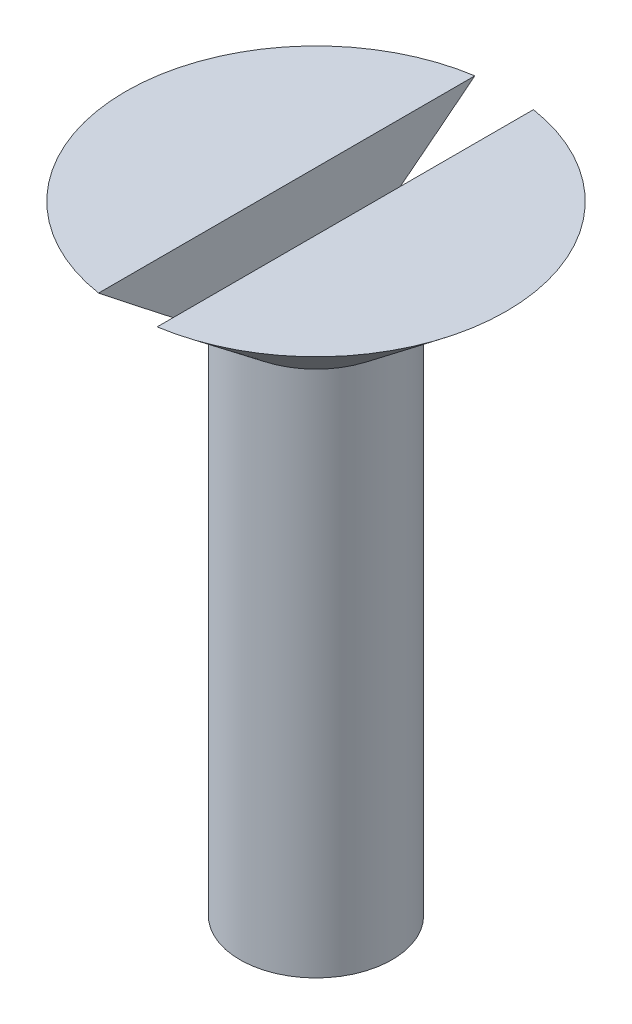
ISO-10303-21;
HEADER;
FILE_DESCRIPTION(('STEP AP214'),'2;1');
FILE_NAME('part.step','',(''),(''),'','','');
FILE_SCHEMA(('AUTOMOTIVE_DESIGN { 1 0 10303 214 1 1 1 1 }'));
ENDSEC;
DATA;
#1=APPLICATION_CONTEXT('core data for automotive mechanical design processes');
#2=APPLICATION_PROTOCOL_DEFINITION('international standard','automotive_design',2000,#1);
#3=PRODUCT_CONTEXT('',#1,'mechanical');
#4=PRODUCT('Part','Part','',(#3));
#5=PRODUCT_RELATED_PRODUCT_CATEGORY('part','',(#4));
#6=PRODUCT_DEFINITION_FORMATION('','',#4);
#7=PRODUCT_DEFINITION_CONTEXT('part definition',#1,'design');
#8=PRODUCT_DEFINITION('design','',#6,#7);
#9=PRODUCT_DEFINITION_SHAPE('','',#8);
#10=(LENGTH_UNIT() NAMED_UNIT(*) SI_UNIT(.MILLI.,.METRE.));
#11=(NAMED_UNIT(*) PLANE_ANGLE_UNIT() SI_UNIT($,.RADIAN.));
#12=(NAMED_UNIT(*) SI_UNIT($,.STERADIAN.) SOLID_ANGLE_UNIT());
#13=UNCERTAINTY_MEASURE_WITH_UNIT(LENGTH_MEASURE(1.E-05),#10,'distance_accuracy_value','');
#14=(GEOMETRIC_REPRESENTATION_CONTEXT(3) GLOBAL_UNCERTAINTY_ASSIGNED_CONTEXT((#13)) GLOBAL_UNIT_ASSIGNED_CONTEXT((#10,
#11,#12)) REPRESENTATION_CONTEXT('',''));
#15=CARTESIAN_POINT('',(0.,0.,0.));
#16=DIRECTION('',(0.,0.,1.));
#17=DIRECTION('',(1.,0.,0.));
#18=AXIS2_PLACEMENT_3D('',#15,#16,#17);
#19=CARTESIAN_POINT('',(6.50000000000002,22.6264981604973,0.));
#20=DIRECTION('',(0.,-1.,0.));
#21=DIRECTION('',(1.,0.,0.));
#22=AXIS2_PLACEMENT_3D('',#19,#20,#21);
#23=PLANE('',#22);
#24=CARTESIAN_POINT('',(0.,22.6264981604973,0.));
#25=DIRECTION('',(0.,1.,0.));
#26=DIRECTION('',(-1.,0.,0.));
#27=AXIS2_PLACEMENT_3D('',#24,#25,#26);
#28=CIRCLE('',#27,6.5);
#29=CARTESIAN_POINT('',(0.999999999999997,22.6264981604973,6.42261628933255));
#30=VERTEX_POINT('',#29);
#31=CARTESIAN_POINT('',(0.999999999999997,22.6264981604973,-6.42261628933257));
#32=VERTEX_POINT('',#31);
#33=EDGE_CURVE('E98',#30,#32,#28,.T.);
#34=ORIENTED_EDGE('',*,*,#33,.T.);
#35=DIRECTION('',(0.,0.,-1.));
#36=VECTOR('',#35,1.);
#37=CARTESIAN_POINT('',(0.999999999999997,22.6264981604973,7.49999999999999));
#38=LINE('',#37,#36);
#39=EDGE_CURVE('E91',#30,#32,#38,.T.);
#40=ORIENTED_EDGE('',*,*,#39,.F.);
#41=EDGE_LOOP('',(#34,#40));
#42=FACE_BOUND('',#41,.T.);
#43=ADVANCED_FACE('F44',(#42),#23,.F.);
#44=CARTESIAN_POINT('',(-1.,22.6264981604973,-6.42261628933256));
#45=VERTEX_POINT('',#44);
#46=CARTESIAN_POINT('',(-1.,22.6264981604973,6.42261628933254));
#47=VERTEX_POINT('',#46);
#48=EDGE_CURVE('E105',#45,#47,#28,.T.);
#49=ORIENTED_EDGE('',*,*,#48,.T.);
#50=DIRECTION('',(0.,0.,1.));
#51=VECTOR('',#50,1.);
#52=CARTESIAN_POINT('',(-1.,22.6264981604973,7.49999999999999));
#53=LINE('',#52,#51);
#54=EDGE_CURVE('E99',#45,#47,#53,.T.);
#55=ORIENTED_EDGE('',*,*,#54,.F.);
#56=EDGE_LOOP('',(#49,#55));
#57=FACE_BOUND('',#56,.T.);
#58=ADVANCED_FACE('F46',(#57),#23,.F.);
#59=CARTESIAN_POINT('',(0.,19.5,0.));
#60=DIRECTION('',(0.,1.,0.));
#61=DIRECTION('',(-1.,0.,0.));
#62=AXIS2_PLACEMENT_3D('',#59,#60,#61);
#63=CONICAL_SURFACE('',#62,2.59807621135329,0.895280898571727);
#64=ORIENTED_EDGE('',*,*,#33,.F.);
#65=CARTESIAN_POINT('',(0.999999999999997,28.9779066227362,14.3919678627795));
#66=CARTESIAN_POINT('',(0.999999999999997,28.568515737515,13.8797975728752));
#67=CARTESIAN_POINT('',(0.999999999999997,28.159178409321,13.3675844242118));
#68=CARTESIAN_POINT('',(0.999999999999997,27.3406414570373,12.3429568360387));
#69=CARTESIAN_POINT('',(0.999999999999997,26.9314418527713,11.8305423806936));
#70=CARTESIAN_POINT('',(0.999999999999997,26.1124587766563,10.8044540069552));
#71=CARTESIAN_POINT('',(0.999999999999997,25.7026758346903,10.290779665593));
#72=CARTESIAN_POINT('',(0.999999999999997,24.8835511692291,9.26316946708095));
#73=CARTESIAN_POINT('',(0.999999999999997,24.4742094030464,8.74923364397171));
#74=CARTESIAN_POINT('',(0.999999999999997,23.8489635977186,7.96318031506497));
#75=CARTESIAN_POINT('',(0.999999999999997,23.6328191557736,7.69125405087661));
#76=CARTESIAN_POINT('',(0.999999999999997,23.2007852203086,7.14719381882096));
#77=CARTESIAN_POINT('',(0.999999999999997,22.9848957298058,6.87505984855711));
#78=CARTESIAN_POINT('',(0.999999999999997,22.5534064052927,6.3304130621767));
#79=CARTESIAN_POINT('',(0.999999999999997,22.3378066933802,6.05790014931072));
#80=CARTESIAN_POINT('',(0.999999999999997,21.90714930459,5.51246494642735));
#81=CARTESIAN_POINT('',(0.999999999999997,21.6920916049026,5.23954267443508));
#82=CARTESIAN_POINT('',(0.999999999999997,21.263123108631,4.69343709136958));
#83=CARTESIAN_POINT('',(0.999999999999997,21.0492111019867,4.4202547310336));
#84=CARTESIAN_POINT('',(0.999999999999997,20.6227311054927,3.8727694723508));
#85=CARTESIAN_POINT('',(0.999999999999997,20.410163334688,3.59846640278985));
#86=CARTESIAN_POINT('',(0.999999999999997,20.0933718272538,3.18557336931416));
#87=CARTESIAN_POINT('',(0.999999999999997,19.9881524518509,3.04774840929994));
#88=CARTESIAN_POINT('',(0.999999999999997,19.778697508504,2.77134102138812));
#89=CARTESIAN_POINT('',(0.999999999999997,19.6744619917711,2.63275855464778));
#90=CARTESIAN_POINT('',(0.999999999999997,19.4675196786719,2.35451211639593));
#91=CARTESIAN_POINT('',(0.999999999999997,19.3648124529729,2.21484846603981));
#92=CARTESIAN_POINT('',(0.999999999999997,19.2126371247218,2.00399999535382));
#93=CARTESIAN_POINT('',(0.999999999999997,19.1622283841718,1.93349471917426));
#94=CARTESIAN_POINT('',(0.999999999999997,19.0622557173489,1.79188848398646));
#95=CARTESIAN_POINT('',(0.999999999999997,19.0126917669353,1.72078754208689));
#96=CARTESIAN_POINT('',(0.999999999999997,18.9417357762063,1.61722495638402));
#97=CARTESIAN_POINT('',(0.999999999999997,18.9198821271097,1.58507957035332));
#98=CARTESIAN_POINT('',(0.999999999999997,18.8764474649958,1.52060449074986));
#99=CARTESIAN_POINT('',(0.999999999999997,18.8548664563562,1.48827479422961));
#100=CARTESIAN_POINT('',(0.999999999999997,18.7905939553486,1.39096490802436));
#101=CARTESIAN_POINT('',(0.999999999999997,18.748376708571,1.32566932247498));
#102=CARTESIAN_POINT('',(0.999999999999997,18.6656357187635,1.19383115347468));
#103=CARTESIAN_POINT('',(0.999999999999997,18.625115415215,1.12728639916538));
#104=CARTESIAN_POINT('',(0.999999999999997,18.5466604542421,0.992688424454655));
#105=CARTESIAN_POINT('',(0.999999999999997,18.5087253114259,0.924635490427712));
#106=CARTESIAN_POINT('',(0.999999999999997,18.4490645297257,0.810087665514408));
#107=CARTESIAN_POINT('',(0.999999999999997,18.4262316566453,0.764178050676975));
#108=CARTESIAN_POINT('',(0.999999999999997,18.3828355407208,0.671304045211592));
#109=CARTESIAN_POINT('',(0.999999999999997,18.362273023927,0.62433932291012));
#110=CARTESIAN_POINT('',(0.999999999999997,18.3052587728146,0.481898587732372));
#111=CARTESIAN_POINT('',(0.999999999999997,18.2732289203948,0.384424522932275));
#112=CARTESIAN_POINT('',(0.999999999999997,18.2432326190659,0.247710345086961));
#113=CARTESIAN_POINT('',(0.999999999999997,18.236509906299,0.210377803305776));
#114=CARTESIAN_POINT('',(0.999999999999997,18.2262627163005,0.135272467919328));
#115=CARTESIAN_POINT('',(0.999999999999997,18.2227375224771,0.097499774878668));
#116=CARTESIAN_POINT('',(0.999999999999997,18.2191303974839,0.0218737055433806));
#117=CARTESIAN_POINT('',(0.999999999999997,18.2190406395421,-0.0159792908447113));
#118=CARTESIAN_POINT('',(0.999999999999997,18.2222893412905,-0.0915393097647047));
#119=CARTESIAN_POINT('',(0.999999999999997,18.2256283651744,-0.129246307248072));
#120=CARTESIAN_POINT('',(0.999999999999997,18.2369126062264,-0.214860491321498));
#121=CARTESIAN_POINT('',(0.999999999999997,18.2458948580726,-0.262630713992371));
#122=CARTESIAN_POINT('',(0.999999999999997,18.2682992222991,-0.357125224430187));
#123=CARTESIAN_POINT('',(0.999999999999997,18.2817249382811,-0.403848630294671));
#124=CARTESIAN_POINT('',(0.999999999999997,18.3121807370557,-0.496477596235179));
#125=CARTESIAN_POINT('',(0.999999999999997,18.329237430202,-0.542374245248644));
#126=CARTESIAN_POINT('',(0.999999999999997,18.3660482046475,-0.633043433795826));
#127=CARTESIAN_POINT('',(0.999999999999997,18.3858016466775,-0.677816236770281));
#128=CARTESIAN_POINT('',(0.999999999999997,18.4281984928972,-0.768199315377871));
#129=CARTESIAN_POINT('',(0.999999999999997,18.4509268694959,-0.813769351802654));
#130=CARTESIAN_POINT('',(0.999999999999997,18.4980576787126,-0.904039369445959));
#131=CARTESIAN_POINT('',(0.999999999999997,18.5224604468309,-0.948739173977955));
#132=CARTESIAN_POINT('',(0.999999999999997,18.5975940848681,-1.08183441315508));
#133=CARTESIAN_POINT('',(0.999999999999997,18.6502168751882,-1.16915774408236));
#134=CARTESIAN_POINT('',(0.999999999999997,18.7586260476015,-1.34210025590692));
#135=CARTESIAN_POINT('',(0.999999999999997,18.8144203445151,-1.42771438191303));
#136=CARTESIAN_POINT('',(0.999999999999997,18.92799313489,-1.59762564413156));
#137=CARTESIAN_POINT('',(0.999999999999997,18.9857718524289,-1.68192263004066));
#138=CARTESIAN_POINT('',(0.999999999999997,19.1028422287608,-1.84982836391522));
#139=CARTESIAN_POINT('',(0.999999999999997,19.1621378849044,-1.93343431042098));
#140=CARTESIAN_POINT('',(0.999999999999997,19.2816884210796,-2.09996951721711));
#141=CARTESIAN_POINT('',(0.999999999999997,19.3419434020603,-2.18289870488524));
#142=CARTESIAN_POINT('',(0.999999999999997,19.4630369808936,-2.34809201071958));
#143=CARTESIAN_POINT('',(0.999999999999997,19.5238742853205,-2.43035707876607));
#144=CARTESIAN_POINT('',(0.999999999999997,19.6460702663081,-2.59449382048462));
#145=CARTESIAN_POINT('',(0.999999999999997,19.7074289232549,-2.67636550877628));
#146=CARTESIAN_POINT('',(0.999999999999997,19.8906155201374,-2.91955586981744));
#147=CARTESIAN_POINT('',(0.999999999999997,20.0130220493924,-3.08043846933572));
#148=CARTESIAN_POINT('',(0.999999999999997,20.2588166948664,-3.40145256607385));
#149=CARTESIAN_POINT('',(0.999999999999997,20.3822048211414,-3.56158405557213));
#150=CARTESIAN_POINT('',(0.999999999999997,20.7533524968205,-4.04123772869702));
#151=CARTESIAN_POINT('',(0.999999999999997,21.0020854675848,-4.36000613795897));
#152=CARTESIAN_POINT('',(0.999999999999997,21.5010475592476,-4.99675496208219));
#153=CARTESIAN_POINT('',(0.999999999999997,21.7512776677439,-5.31473460054134));
#154=CARTESIAN_POINT('',(0.999999999999997,22.2525145529092,-5.95007045000749));
#155=CARTESIAN_POINT('',(0.999999999999997,22.5035213133728,-6.26742667379948));
#156=CARTESIAN_POINT('',(0.999999999999997,23.0050570644137,-6.9005262460868));
#157=CARTESIAN_POINT('',(0.999999999999997,23.2555841634663,-7.21627109419749));
#158=CARTESIAN_POINT('',(0.999999999999997,23.756970731446,-7.8474995589358));
#159=CARTESIAN_POINT('',(0.999999999999997,24.0078302021778,-8.16298317412986));
#160=CARTESIAN_POINT('',(0.999999999999997,24.7606432403324,-9.10902565197748));
#161=CARTESIAN_POINT('',(0.999999999999997,25.2629392165441,-9.73931199840986));
#162=CARTESIAN_POINT('',(0.999999999999997,26.0326558672713,-10.7043808696388));
#163=CARTESIAN_POINT('',(0.999999999999997,26.2998986365069,-11.0393053785866));
#164=CARTESIAN_POINT('',(0.999999999999997,26.8345098396758,-11.709084258608));
#165=CARTESIAN_POINT('',(0.999999999999997,27.1018782797124,-12.0439386248106));
#166=CARTESIAN_POINT('',(0.999999999999997,27.6373252618817,-12.7143624554897));
#167=CARTESIAN_POINT('',(0.999999999999997,27.905404002634,-13.049931761316));
#168=CARTESIAN_POINT('',(0.999999999999997,28.4416153514496,-13.7209969424729));
#169=CARTESIAN_POINT('',(0.999999999999997,28.7097479557163,-14.056492820837));
#170=CARTESIAN_POINT('',(0.999999999999997,28.9779066227362,-14.3919678627795));
#171=B_SPLINE_CURVE_WITH_KNOTS('',3,(#65,#66,#67,#68,#69,#70,#71,#72,#73,#74,#75,#76,#77,#78,
#79,#80,#81,#82,#83,#84,#85,#86,#87,#88,#89,#90,#91,#92,#93,#94,#95,#96,#97,#98,#99,#100,#101,
#102,#103,#104,#105,#106,#107,#108,#109,#110,#111,#112,#113,#114,#115,#116,#117,#118,#119,#120,
#121,#122,#123,#124,#125,#126,#127,#128,#129,#130,#131,#132,#133,#134,#135,#136,#137,#138,#139,
#140,#141,#142,#143,#144,#145,#146,#147,#148,#149,#150,#151,#152,#153,#154,#155,#156,#157,#158,
#159,#160,#161,#162,#163,#164,#165,#166,#167,#168,#169,#170),.UNSPECIFIED.,.F.,.F.,(4,2,2,2,2,2,
2,2,2,2,2,2,2,2,2,2,2,2,2,2,2,2,2,2,2,2,2,2,2,2,2,2,2,2,2,2,2,2,2,2,2,2,2,2,2,2,2,2,2,2,2,2,4),
(0.,1.96704701295933,3.93430800445346,5.90561470905986,7.87670954267214,8.91880387737471,
9.96091042339183,11.0033680758134,12.0457810999985,13.0866841991685,14.1277527565305,
14.6479432967339,15.1681607658151,15.6882292243578,15.9482411975607,16.2082457281422,
16.3248556739815,16.4414674899113,16.6747107940333,16.9084059867496,17.1420571791029,
17.2958147808456,17.4496214120494,17.7556896967759,17.8693742607139,17.9830333406523,
18.0964334616603,18.2098522452361,18.3554061835951,18.5010784550709,18.6478575202994,
18.7946018515152,18.9473269631006,19.1000827663056,19.4058210828358,19.712359103462,
20.0189318524031,20.3264186823635,20.633938085609,20.9408857159045,21.2478218491297,
21.8542792311256,22.4607428340253,23.6737189646964,24.8876106633608,26.1014772020519,
27.3106616962093,28.5198527826056,30.9377147109385,32.2231477609001,33.508651512602,
34.7971610049675,36.085599274681),.UNSPECIFIED.);
#172=CARTESIAN_POINT('',(0.999999999999997,20.6264981604973,3.87707866121605));
#173=VERTEX_POINT('',#172);
#174=EDGE_CURVE('E13',#30,#173,#171,.T.);
#175=ORIENTED_EDGE('',*,*,#174,.T.);
#176=CARTESIAN_POINT('',(0.,20.6264981604973,0.));
#177=DIRECTION('',(0.,-1.,0.));
#178=DIRECTION('',(0.,0.,-1.));
#179=AXIS2_PLACEMENT_3D('',#176,#177,#178);
#180=CIRCLE('',#179,4.00396540260488);
#181=CARTESIAN_POINT('',(-1.,20.6264981604973,3.87707866121604));
#182=VERTEX_POINT('',#181);
#183=EDGE_CURVE('E109',#173,#182,#180,.T.);
#184=ORIENTED_EDGE('',*,*,#183,.T.);
#185=CARTESIAN_POINT('',(-1.,28.9779066227362,-14.3919678627795));
#186=CARTESIAN_POINT('',(-1.,28.568515737515,-13.8797975728752));
#187=CARTESIAN_POINT('',(-1.,28.159178409321,-13.3675844242118));
#188=CARTESIAN_POINT('',(-1.,27.3406414570373,-12.3429568360387));
#189=CARTESIAN_POINT('',(-1.,26.9314418527713,-11.8305423806936));
#190=CARTESIAN_POINT('',(-1.,26.1124587766563,-10.8044540069552));
#191=CARTESIAN_POINT('',(-1.,25.7026758346903,-10.290779665593));
#192=CARTESIAN_POINT('',(-1.,24.8835511692291,-9.26316946708094));
#193=CARTESIAN_POINT('',(-1.,24.4742094030464,-8.7492336439717));
#194=CARTESIAN_POINT('',(-1.,23.8489635977186,-7.96318031506496));
#195=CARTESIAN_POINT('',(-1.,23.6328191557736,-7.6912540508766));
#196=CARTESIAN_POINT('',(-1.,23.2007852203086,-7.14719381882095));
#197=CARTESIAN_POINT('',(-1.,22.9848957298058,-6.8750598485571));
#198=CARTESIAN_POINT('',(-1.,22.5534064052927,-6.33041306217669));
#199=CARTESIAN_POINT('',(-1.,22.3378066933802,-6.05790014931071));
#200=CARTESIAN_POINT('',(-1.,21.90714930459,-5.51246494642734));
#201=CARTESIAN_POINT('',(-1.,21.6920916049026,-5.23954267443507));
#202=CARTESIAN_POINT('',(-1.,21.263123108631,-4.69343709136957));
#203=CARTESIAN_POINT('',(-1.,21.0492111019867,-4.42025473103359));
#204=CARTESIAN_POINT('',(-1.,20.6227311054927,-3.87276947235079));
#205=CARTESIAN_POINT('',(-1.,20.410163334688,-3.59846640278984));
#206=CARTESIAN_POINT('',(-1.,20.0933718272538,-3.18557336931415));
#207=CARTESIAN_POINT('',(-1.,19.9881524518509,-3.04774840929993));
#208=CARTESIAN_POINT('',(-1.,19.778697508504,-2.77134102138811));
#209=CARTESIAN_POINT('',(-1.,19.6744619917711,-2.63275855464777));
#210=CARTESIAN_POINT('',(-1.,19.4675196786719,-2.35451211639592));
#211=CARTESIAN_POINT('',(-1.,19.3648124529729,-2.21484846603981));
#212=CARTESIAN_POINT('',(-1.,19.2126371247218,-2.00399999535381));
#213=CARTESIAN_POINT('',(-1.,19.1622283841718,-1.93349471917426));
#214=CARTESIAN_POINT('',(-1.,19.0622557173489,-1.79188848398645));
#215=CARTESIAN_POINT('',(-1.,19.0126917669353,-1.72078754208689));
#216=CARTESIAN_POINT('',(-1.,18.9417357762063,-1.61722495638402));
#217=CARTESIAN_POINT('',(-1.,18.9198821271098,-1.58507957035331));
#218=CARTESIAN_POINT('',(-1.,18.8764474649958,-1.52060449074985));
#219=CARTESIAN_POINT('',(-1.,18.8548664563562,-1.4882747942296));
#220=CARTESIAN_POINT('',(-1.,18.7905939553487,-1.39096490802435));
#221=CARTESIAN_POINT('',(-1.,18.748376708571,-1.32566932247497));
#222=CARTESIAN_POINT('',(-1.,18.6656357187635,-1.19383115347468));
#223=CARTESIAN_POINT('',(-1.,18.6251154152151,-1.12728639916538));
#224=CARTESIAN_POINT('',(-1.,18.5466604542421,-0.992688424454649));
#225=CARTESIAN_POINT('',(-1.,18.5087253114259,-0.924635490427708));
#226=CARTESIAN_POINT('',(-1.,18.4490645297258,-0.810087665514404));
#227=CARTESIAN_POINT('',(-1.,18.4262316566453,-0.76417805067697));
#228=CARTESIAN_POINT('',(-1.,18.3828355407209,-0.671304045211585));
#229=CARTESIAN_POINT('',(-1.,18.362273023927,-0.624339322910113));
#230=CARTESIAN_POINT('',(-1.,18.3052587728146,-0.481898587732362));
#231=CARTESIAN_POINT('',(-1.,18.2732289203948,-0.384424522932262));
#232=CARTESIAN_POINT('',(-1.,18.2432326190659,-0.247710345086945));
#233=CARTESIAN_POINT('',(-1.,18.236509906299,-0.21037780330576));
#234=CARTESIAN_POINT('',(-1.,18.2262627163005,-0.135272467919308));
#235=CARTESIAN_POINT('',(-1.,18.2227375224771,-0.0974997748786465));
#236=CARTESIAN_POINT('',(-1.,18.219130397484,-0.0218737055433551));
#237=CARTESIAN_POINT('',(-1.,18.2190406395421,0.0159792908447388));
#238=CARTESIAN_POINT('',(-1.,18.2222893412906,0.0915393097647357));
#239=CARTESIAN_POINT('',(-1.,18.2256283651744,0.129246307248105));
#240=CARTESIAN_POINT('',(-1.,18.2369126062265,0.214860491321536));
#241=CARTESIAN_POINT('',(-1.,18.2458948580727,0.262630713992413));
#242=CARTESIAN_POINT('',(-1.,18.2682992222992,0.357125224430235));
#243=CARTESIAN_POINT('',(-1.,18.2817249382811,0.403848630294721));
#244=CARTESIAN_POINT('',(-1.,18.3121807370558,0.496477596235236));
#245=CARTESIAN_POINT('',(-1.,18.3292374302021,0.542374245248705));
#246=CARTESIAN_POINT('',(-1.,18.3660482046475,0.633043433795894));
#247=CARTESIAN_POINT('',(-1.,18.3858016466776,0.677816236770352));
#248=CARTESIAN_POINT('',(-1.,18.4281984928972,0.768199315377951));
#249=CARTESIAN_POINT('',(-1.,18.4509268694959,0.813769351802741));
#250=CARTESIAN_POINT('',(-1.,18.4980576787127,0.904039369446059));
#251=CARTESIAN_POINT('',(-1.,18.522460446831,0.948739173978061));
#252=CARTESIAN_POINT('',(-1.,18.5975940848682,1.0818344131552));
#253=CARTESIAN_POINT('',(-1.,18.6502168751883,1.1691577440825));
#254=CARTESIAN_POINT('',(-1.,18.7586260476016,1.34210025590708));
#255=CARTESIAN_POINT('',(-1.,18.8144203445152,1.4277143819132));
#256=CARTESIAN_POINT('',(-1.,18.9279931348901,1.59762564413176));
#257=CARTESIAN_POINT('',(-1.,18.9857718524291,1.68192263004087));
#258=CARTESIAN_POINT('',(-1.,19.102842228761,1.84982836391545));
#259=CARTESIAN_POINT('',(-1.,19.1621378849046,1.93343431042122));
#260=CARTESIAN_POINT('',(-1.,19.2816884210798,2.09996951721738));
#261=CARTESIAN_POINT('',(-1.,19.3419434020605,2.18289870488552));
#262=CARTESIAN_POINT('',(-1.,19.4630369808938,2.34809201071988));
#263=CARTESIAN_POINT('',(-1.,19.5238742853207,2.43035707876639));
#264=CARTESIAN_POINT('',(-1.,19.6460702663084,2.59449382048495));
#265=CARTESIAN_POINT('',(-1.,19.7074289232552,2.67636550877663));
#266=CARTESIAN_POINT('',(-1.,19.8906155201377,2.91955586981783));
#267=CARTESIAN_POINT('',(-1.,20.0130220493927,3.08043846933613));
#268=CARTESIAN_POINT('',(-1.,20.2588166948667,3.4014525660743));
#269=CARTESIAN_POINT('',(-1.,20.3822048211418,3.56158405557261));
#270=CARTESIAN_POINT('',(-1.,20.7533524968209,4.04123772869757));
#271=CARTESIAN_POINT('',(-1.,21.0020854675853,4.36000613795957));
#272=CARTESIAN_POINT('',(-1.,21.5010475592482,4.99675496208288));
#273=CARTESIAN_POINT('',(-1.,21.7512776677445,5.31473460054208));
#274=CARTESIAN_POINT('',(-1.,22.2525145529098,5.95007045000832));
#275=CARTESIAN_POINT('',(-1.,22.5035213133735,6.26742667380036));
#276=CARTESIAN_POINT('',(-1.,23.0050570644145,6.90052624608777));
#277=CARTESIAN_POINT('',(-1.,23.2555841634671,7.2162710941985));
#278=CARTESIAN_POINT('',(-1.,23.7569707314469,7.84749955893691));
#279=CARTESIAN_POINT('',(-1.,24.0078302021787,8.16298317413101));
#280=CARTESIAN_POINT('',(-1.,24.7606432403334,9.10902565197877));
#281=CARTESIAN_POINT('',(-1.,25.2629392165452,9.73931199841124));
#282=CARTESIAN_POINT('',(-1.,26.0326558672724,10.7043808696402));
#283=CARTESIAN_POINT('',(-1.,26.2998986365079,11.0393053785878));
#284=CARTESIAN_POINT('',(-1.,26.8345098396766,11.709084258609));
#285=CARTESIAN_POINT('',(-1.,27.1018782797131,12.0439386248115));
#286=CARTESIAN_POINT('',(-1.,27.6373252618822,12.7143624554903));
#287=CARTESIAN_POINT('',(-1.,27.9054040026344,13.0499317613165));
#288=CARTESIAN_POINT('',(-1.,28.4416153514498,13.7209969424731));
#289=CARTESIAN_POINT('',(-1.,28.7097479557164,14.0564928208372));
#290=CARTESIAN_POINT('',(-1.,28.9779066227362,14.3919678627795));
#291=B_SPLINE_CURVE_WITH_KNOTS('',3,(#185,#186,#187,#188,#189,#190,#191,#192,#193,#194,#195,
#196,#197,#198,#199,#200,#201,#202,#203,#204,#205,#206,#207,#208,#209,#210,#211,#212,#213,#214,
#215,#216,#217,#218,#219,#220,#221,#222,#223,#224,#225,#226,#227,#228,#229,#230,#231,#232,#233,
#234,#235,#236,#237,#238,#239,#240,#241,#242,#243,#244,#245,#246,#247,#248,#249,#250,#251,#252,
#253,#254,#255,#256,#257,#258,#259,#260,#261,#262,#263,#264,#265,#266,#267,#268,#269,#270,#271,
#272,#273,#274,#275,#276,#277,#278,#279,#280,#281,#282,#283,#284,#285,#286,#287,#288,#289,#290),
.UNSPECIFIED.,.F.,.F.,(4,2,2,2,2,2,2,2,2,2,2,2,2,2,2,2,2,2,2,2,2,2,2,2,2,2,2,2,2,2,2,2,2,2,2,2,
2,2,2,2,2,2,2,2,2,2,2,2,2,2,2,2,4),(0.,1.96704701295933,3.93430800445346,5.90561470905987,
7.87670954267215,8.91880387737472,9.96091042339184,11.0033680758134,12.0457810999985,
13.0866841991685,14.1277527565305,14.6479432967339,15.1681607658151,15.6882292243578,
15.9482411975607,16.2082457281422,16.3248556739815,16.4414674899113,16.6747107940333,
16.9084059867496,17.1420571791029,17.2958147808455,17.4496214120494,17.7556896967759,
17.8693742607139,17.9830333406523,18.0964334616603,18.2098522452361,18.3554061835951,
18.501078455071,18.6478575202995,18.7946018515153,18.9473269631007,19.1000827663057,
19.405821082836,19.7123591034622,20.0189318524034,20.3264186823638,20.6339380856094,
20.9408857159049,21.2478218491301,21.8542792311261,22.460742834026,23.6737189646972,
24.8876106633617,26.101477202053,27.3106616962106,28.5198527826071,30.9377147109403,
32.2231477609015,33.508651512603,34.7971610049679,36.0855992746809),.UNSPECIFIED.);
#292=EDGE_CURVE('E58',#182,#47,#291,.T.);
#293=ORIENTED_EDGE('',*,*,#292,.T.);
#294=ORIENTED_EDGE('',*,*,#48,.F.);
#295=CARTESIAN_POINT('',(-1.,20.6264981604973,-3.87707866121605));
#296=VERTEX_POINT('',#295);
#297=EDGE_CURVE('E107',#45,#296,#291,.T.);
#298=ORIENTED_EDGE('',*,*,#297,.T.);
#299=CARTESIAN_POINT('',(0.999999999999997,20.6264981604973,-3.87707866121607));
#300=VERTEX_POINT('',#299);
#301=EDGE_CURVE('E104',#296,#300,#180,.T.);
#302=ORIENTED_EDGE('',*,*,#301,.T.);
#303=EDGE_CURVE('E48',#300,#32,#171,.T.);
#304=ORIENTED_EDGE('',*,*,#303,.T.);
#305=EDGE_LOOP('',(#64,#175,#184,#293,#294,#298,#302,#304));
#306=FACE_BOUND('',#305,.T.);
#307=CARTESIAN_POINT('',(0.,19.5,0.));
#308=DIRECTION('',(0.,1.,0.));
#309=DIRECTION('',(-1.,0.,0.));
#310=AXIS2_PLACEMENT_3D('',#307,#308,#309);
#311=CIRCLE('',#310,2.59807621135329);
#312=CARTESIAN_POINT('',(-2.59807621135327,19.5,0.));
#313=VERTEX_POINT('',#312);
#314=EDGE_CURVE('E111',#313,#313,#311,.T.);
#315=ORIENTED_EDGE('',*,*,#314,.T.);
#316=EDGE_LOOP('',(#315));
#317=FACE_BOUND('',#316,.T.);
#318=ADVANCED_FACE('F101',(#306,#317),#63,.T.);
#319=CARTESIAN_POINT('',(0.,22.6264981604973,0.));
#320=DIRECTION('',(0.,1.,0.));
#321=DIRECTION('',(-1.,0.,0.));
#322=AXIS2_PLACEMENT_3D('',#319,#320,#321);
#323=CYLINDRICAL_SURFACE('',#322,2.5980762113533);
#324=ORIENTED_EDGE('',*,*,#314,.F.);
#325=EDGE_LOOP('',(#324));
#326=FACE_BOUND('',#325,.T.);
#327=CARTESIAN_POINT('',(0.,1.50000000000002,0.));
#328=DIRECTION('',(0.,1.,0.));
#329=DIRECTION('',(-1.,0.,0.));
#330=AXIS2_PLACEMENT_3D('',#327,#328,#329);
#331=CIRCLE('',#330,2.59807621135331);
#332=CARTESIAN_POINT('',(-2.5980762113533,1.50000000000002,0.));
#333=VERTEX_POINT('',#332);
#334=EDGE_CURVE('E155',#333,#333,#331,.T.);
#335=ORIENTED_EDGE('',*,*,#334,.T.);
#336=EDGE_LOOP('',(#335));
#337=FACE_BOUND('',#336,.T.);
#338=ADVANCED_FACE('F133',(#326,#337),#323,.T.);
#339=CARTESIAN_POINT('',(0.,0.,0.));
#340=DIRECTION('',(0.,1.,0.));
#341=DIRECTION('',(-1.,0.,0.));
#342=AXIS2_PLACEMENT_3D('',#339,#340,#341);
#343=CONICAL_SURFACE('',#342,0.,1.04719755119659);
#344=ORIENTED_EDGE('',*,*,#334,.F.);
#345=EDGE_LOOP('',(#344));
#346=FACE_BOUND('',#345,.T.);
#347=CARTESIAN_POINT('',(0.,0.,0.));
#348=VERTEX_POINT('',#347);
#349=VERTEX_LOOP('',#348);
#350=FACE_BOUND('',#349,.T.);
#351=ADVANCED_FACE('F131',(#346,#350),#343,.T.);
#352=CARTESIAN_POINT('',(0.999999999999997,20.6264981604973,7.49999999999999));
#353=DIRECTION('',(1.,0.,0.));
#354=DIRECTION('',(0.,0.,-1.));
#355=AXIS2_PLACEMENT_3D('',#352,#353,#354);
#356=PLANE('',#355);
#357=ORIENTED_EDGE('',*,*,#39,.T.);
#358=ORIENTED_EDGE('',*,*,#303,.F.);
#359=DIRECTION('',(0.,0.,-1.));
#360=VECTOR('',#359,1.);
#361=CARTESIAN_POINT('',(0.999999999999997,20.6264981604973,7.49999999999999));
#362=LINE('',#361,#360);
#363=EDGE_CURVE('E65',#173,#300,#362,.T.);
#364=ORIENTED_EDGE('',*,*,#363,.F.);
#365=ORIENTED_EDGE('',*,*,#174,.F.);
#366=EDGE_LOOP('',(#357,#358,#364,#365));
#367=FACE_BOUND('',#366,.T.);
#368=ADVANCED_FACE('F90',(#367),#356,.F.);
#369=CARTESIAN_POINT('',(-1.,20.6264981604973,7.49999999999999));
#370=DIRECTION('',(-1.,0.,0.));
#371=DIRECTION('',(0.,0.,1.));
#372=AXIS2_PLACEMENT_3D('',#369,#370,#371);
#373=PLANE('',#372);
#374=ORIENTED_EDGE('',*,*,#54,.T.);
#375=ORIENTED_EDGE('',*,*,#292,.F.);
#376=DIRECTION('',(0.,0.,1.));
#377=VECTOR('',#376,1.);
#378=CARTESIAN_POINT('',(-1.,20.6264981604973,7.49999999999999));
#379=LINE('',#378,#377);
#380=EDGE_CURVE('E154',#296,#182,#379,.T.);
#381=ORIENTED_EDGE('',*,*,#380,.F.);
#382=ORIENTED_EDGE('',*,*,#297,.F.);
#383=EDGE_LOOP('',(#374,#375,#381,#382));
#384=FACE_BOUND('',#383,.T.);
#385=ADVANCED_FACE('F122',(#384),#373,.F.);
#386=CARTESIAN_POINT('',(0.,20.6264981604973,0.));
#387=DIRECTION('',(0.,-1.,0.));
#388=DIRECTION('',(0.,0.,-1.));
#389=AXIS2_PLACEMENT_3D('',#386,#387,#388);
#390=PLANE('',#389);
#391=ORIENTED_EDGE('',*,*,#363,.T.);
#392=ORIENTED_EDGE('',*,*,#301,.F.);
#393=ORIENTED_EDGE('',*,*,#380,.T.);
#394=ORIENTED_EDGE('',*,*,#183,.F.);
#395=EDGE_LOOP('',(#391,#392,#393,#394));
#396=FACE_BOUND('',#395,.T.);
#397=ADVANCED_FACE('F126',(#396),#390,.F.);
#398=CLOSED_SHELL('',(#43,#58,#318,#338,#351,#368,#385,#397));
#399=MANIFOLD_SOLID_BREP('B2',#398);
#400=ADVANCED_BREP_SHAPE_REPRESENTATION('',(#18,#399),#14);
#401=SHAPE_DEFINITION_REPRESENTATION(#9,#400);
ENDSEC;
END-ISO-10303-21;
